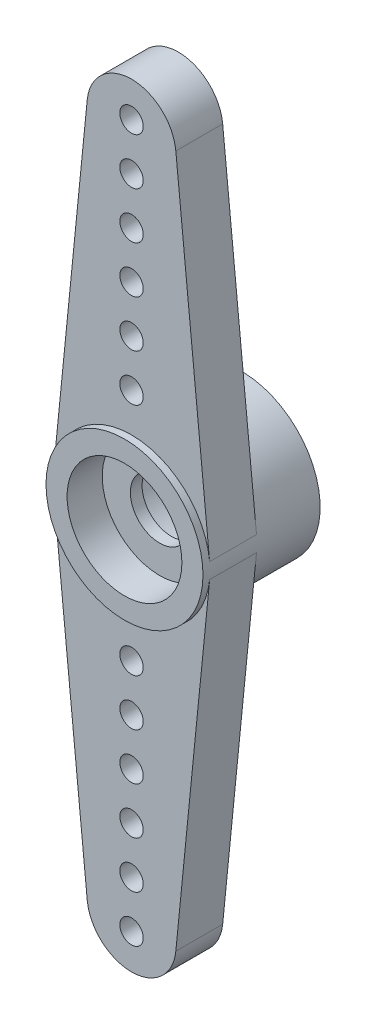
ISO-10303-21;
HEADER;
FILE_DESCRIPTION(('STEP AP214'),'2;1');
FILE_NAME('part.step','',(''),(''),'','','');
FILE_SCHEMA(('AUTOMOTIVE_DESIGN { 1 0 10303 214 1 1 1 1 }'));
ENDSEC;
DATA;
#1=APPLICATION_CONTEXT('core data for automotive mechanical design processes');
#2=APPLICATION_PROTOCOL_DEFINITION('international standard','automotive_design',2000,#1);
#3=PRODUCT_CONTEXT('',#1,'mechanical');
#4=PRODUCT('Part','Part','',(#3));
#5=PRODUCT_RELATED_PRODUCT_CATEGORY('part','',(#4));
#6=PRODUCT_DEFINITION_FORMATION('','',#4);
#7=PRODUCT_DEFINITION_CONTEXT('part definition',#1,'design');
#8=PRODUCT_DEFINITION('design','',#6,#7);
#9=PRODUCT_DEFINITION_SHAPE('','',#8);
#10=(LENGTH_UNIT() NAMED_UNIT(*) SI_UNIT(.MILLI.,.METRE.));
#11=(NAMED_UNIT(*) PLANE_ANGLE_UNIT() SI_UNIT($,.RADIAN.));
#12=(NAMED_UNIT(*) SI_UNIT($,.STERADIAN.) SOLID_ANGLE_UNIT());
#13=UNCERTAINTY_MEASURE_WITH_UNIT(LENGTH_MEASURE(1.E-05),#10,'distance_accuracy_value','');
#14=(GEOMETRIC_REPRESENTATION_CONTEXT(3) GLOBAL_UNCERTAINTY_ASSIGNED_CONTEXT((#13)) GLOBAL_UNIT_ASSIGNED_CONTEXT((#10,
#11,#12)) REPRESENTATION_CONTEXT('',''));
#15=CARTESIAN_POINT('',(0.,0.,0.));
#16=DIRECTION('',(0.,0.,1.));
#17=DIRECTION('',(1.,0.,0.));
#18=AXIS2_PLACEMENT_3D('',#15,#16,#17);
#19=CARTESIAN_POINT('',(0.,0.,-2.7));
#20=DIRECTION('',(0.,0.,1.));
#21=DIRECTION('',(1.,0.,0.));
#22=AXIS2_PLACEMENT_3D('',#19,#20,#21);
#23=CYLINDRICAL_SURFACE('',#22,1.25);
#24=CARTESIAN_POINT('',(0.,0.,0.8));
#25=DIRECTION('',(0.,0.,1.));
#26=DIRECTION('',(1.,0.,0.));
#27=AXIS2_PLACEMENT_3D('',#24,#25,#26);
#28=CIRCLE('',#27,1.25);
#29=CARTESIAN_POINT('',(1.25,0.,0.8));
#30=VERTEX_POINT('',#29);
#31=EDGE_CURVE('E175',#30,#30,#28,.T.);
#32=ORIENTED_EDGE('',*,*,#31,.T.);
#33=EDGE_LOOP('',(#32));
#34=FACE_BOUND('',#33,.T.);
#35=CARTESIAN_POINT('',(0.,0.,0.3));
#36=DIRECTION('',(0.,0.,-1.));
#37=DIRECTION('',(-1.,0.,0.));
#38=AXIS2_PLACEMENT_3D('',#35,#36,#37);
#39=CIRCLE('',#38,1.25);
#40=CARTESIAN_POINT('',(-1.25,0.,0.3));
#41=VERTEX_POINT('',#40);
#42=EDGE_CURVE('E43',#41,#41,#39,.F.);
#43=ORIENTED_EDGE('',*,*,#42,.F.);
#44=EDGE_LOOP('',(#43));
#45=FACE_BOUND('',#44,.T.);
#46=ADVANCED_FACE('F39',(#34,#45),#23,.F.);
#47=CARTESIAN_POINT('',(0.,0.,0.));
#48=DIRECTION('',(0.,0.,1.));
#49=DIRECTION('',(1.,0.,0.));
#50=AXIS2_PLACEMENT_3D('',#47,#48,#49);
#51=PLANE('',#50);
#52=CARTESIAN_POINT('',(0.,9.,0.));
#53=DIRECTION('',(0.,0.,1.));
#54=DIRECTION('',(1.,0.,0.));
#55=AXIS2_PLACEMENT_3D('',#52,#53,#54);
#56=CIRCLE('',#55,0.5);
#57=CARTESIAN_POINT('',(0.5,9.,0.));
#58=VERTEX_POINT('',#57);
#59=EDGE_CURVE('E192',#58,#58,#56,.T.);
#60=ORIENTED_EDGE('',*,*,#59,.T.);
#61=EDGE_LOOP('',(#60));
#62=FACE_BOUND('',#61,.T.);
#63=CARTESIAN_POINT('',(0.,13.,0.));
#64=DIRECTION('',(0.,0.,1.));
#65=DIRECTION('',(1.,0.,0.));
#66=AXIS2_PLACEMENT_3D('',#63,#64,#65);
#67=CIRCLE('',#66,0.5);
#68=CARTESIAN_POINT('',(0.5,13.,0.));
#69=VERTEX_POINT('',#68);
#70=EDGE_CURVE('E195',#69,#69,#67,.T.);
#71=ORIENTED_EDGE('',*,*,#70,.T.);
#72=EDGE_LOOP('',(#71));
#73=FACE_BOUND('',#72,.T.);
#74=CARTESIAN_POINT('',(0.,11.,0.));
#75=DIRECTION('',(0.,0.,1.));
#76=DIRECTION('',(1.,0.,0.));
#77=AXIS2_PLACEMENT_3D('',#74,#75,#76);
#78=CIRCLE('',#77,0.5);
#79=CARTESIAN_POINT('',(0.5,11.,0.));
#80=VERTEX_POINT('',#79);
#81=EDGE_CURVE('E198',#80,#80,#78,.T.);
#82=ORIENTED_EDGE('',*,*,#81,.T.);
#83=EDGE_LOOP('',(#82));
#84=FACE_BOUND('',#83,.T.);
#85=CARTESIAN_POINT('',(0.,7.,0.));
#86=DIRECTION('',(0.,0.,1.));
#87=DIRECTION('',(1.,0.,0.));
#88=AXIS2_PLACEMENT_3D('',#85,#86,#87);
#89=CIRCLE('',#88,0.5);
#90=CARTESIAN_POINT('',(0.5,7.,0.));
#91=VERTEX_POINT('',#90);
#92=EDGE_CURVE('E201',#91,#91,#89,.T.);
#93=ORIENTED_EDGE('',*,*,#92,.T.);
#94=EDGE_LOOP('',(#93));
#95=FACE_BOUND('',#94,.T.);
#96=CARTESIAN_POINT('',(0.,5.,0.));
#97=DIRECTION('',(0.,0.,1.));
#98=DIRECTION('',(1.,0.,0.));
#99=AXIS2_PLACEMENT_3D('',#96,#97,#98);
#100=CIRCLE('',#99,0.5);
#101=CARTESIAN_POINT('',(0.5,5.,0.));
#102=VERTEX_POINT('',#101);
#103=EDGE_CURVE('E204',#102,#102,#100,.T.);
#104=ORIENTED_EDGE('',*,*,#103,.T.);
#105=EDGE_LOOP('',(#104));
#106=FACE_BOUND('',#105,.T.);
#107=CARTESIAN_POINT('',(0.,15.,0.));
#108=DIRECTION('',(0.,0.,1.));
#109=DIRECTION('',(1.,0.,0.));
#110=AXIS2_PLACEMENT_3D('',#107,#108,#109);
#111=CIRCLE('',#110,0.5);
#112=CARTESIAN_POINT('',(0.500000000000002,15.,0.));
#113=VERTEX_POINT('',#112);
#114=EDGE_CURVE('E184',#113,#113,#111,.T.);
#115=ORIENTED_EDGE('',*,*,#114,.T.);
#116=EDGE_LOOP('',(#115));
#117=FACE_BOUND('',#116,.T.);
#118=CARTESIAN_POINT('',(0.,0.,0.));
#119=DIRECTION('',(0.,0.,-1.));
#120=DIRECTION('',(-1.,0.,0.));
#121=AXIS2_PLACEMENT_3D('',#118,#119,#120);
#122=CIRCLE('',#121,3.34999999999984);
#123=CARTESIAN_POINT('',(-3.33343772462327,0.33270547945204,0.));
#124=VERTEX_POINT('',#123);
#125=CARTESIAN_POINT('',(3.33343772462327,0.332705479452039,0.));
#126=VERTEX_POINT('',#125);
#127=EDGE_CURVE('E51',#124,#126,#122,.T.);
#128=ORIENTED_EDGE('',*,*,#127,.F.);
#129=DIRECTION('',(-0.0993150684931509,-0.995056037201022,0.));
#130=VECTOR('',#129,1.);
#131=CARTESIAN_POINT('',(-3.33343772462342,0.332705479452055,0.));
#132=LINE('',#131,#130);
#133=CARTESIAN_POINT('',(-1.89060647068194,14.788698630137,0.));
#134=VERTEX_POINT('',#133);
#135=EDGE_CURVE('E131',#134,#124,#132,.T.);
#136=ORIENTED_EDGE('',*,*,#135,.F.);
#137=CARTESIAN_POINT('',(0.,14.6,0.));
#138=DIRECTION('',(0.,0.,1.));
#139=DIRECTION('',(-1.,0.,0.));
#140=AXIS2_PLACEMENT_3D('',#137,#138,#139);
#141=CIRCLE('',#140,1.9);
#142=CARTESIAN_POINT('',(1.89060647068194,14.788698630137,0.));
#143=VERTEX_POINT('',#142);
#144=EDGE_CURVE('E128',#143,#134,#141,.T.);
#145=ORIENTED_EDGE('',*,*,#144,.F.);
#146=DIRECTION('',(-0.0993150684931505,0.995056037201022,0.));
#147=VECTOR('',#146,1.);
#148=CARTESIAN_POINT('',(3.33343772462342,0.332705479452054,0.));
#149=LINE('',#148,#147);
#150=EDGE_CURVE('E126',#126,#143,#149,.T.);
#151=ORIENTED_EDGE('',*,*,#150,.F.);
#152=EDGE_LOOP('',(#128,#136,#145,#151));
#153=FACE_BOUND('',#152,.T.);
#154=ADVANCED_FACE('F288',(#62,#73,#84,#95,#106,#117,#153),#51,.F.);
#155=CARTESIAN_POINT('',(0.,-11.,0.));
#156=DIRECTION('',(0.,0.,1.));
#157=DIRECTION('',(1.,0.,0.));
#158=AXIS2_PLACEMENT_3D('',#155,#156,#157);
#159=CIRCLE('',#158,0.5);
#160=CARTESIAN_POINT('',(0.5,-11.,0.));
#161=VERTEX_POINT('',#160);
#162=EDGE_CURVE('E207',#161,#161,#159,.T.);
#163=ORIENTED_EDGE('',*,*,#162,.T.);
#164=EDGE_LOOP('',(#163));
#165=FACE_BOUND('',#164,.T.);
#166=CARTESIAN_POINT('',(0.,-9.,0.));
#167=DIRECTION('',(0.,0.,1.));
#168=DIRECTION('',(1.,0.,0.));
#169=AXIS2_PLACEMENT_3D('',#166,#167,#168);
#170=CIRCLE('',#169,0.5);
#171=CARTESIAN_POINT('',(0.5,-9.,0.));
#172=VERTEX_POINT('',#171);
#173=EDGE_CURVE('E210',#172,#172,#170,.T.);
#174=ORIENTED_EDGE('',*,*,#173,.T.);
#175=EDGE_LOOP('',(#174));
#176=FACE_BOUND('',#175,.T.);
#177=CARTESIAN_POINT('',(0.,-13.,0.));
#178=DIRECTION('',(0.,0.,1.));
#179=DIRECTION('',(1.,0.,0.));
#180=AXIS2_PLACEMENT_3D('',#177,#178,#179);
#181=CIRCLE('',#180,0.5);
#182=CARTESIAN_POINT('',(0.5,-13.,0.));
#183=VERTEX_POINT('',#182);
#184=EDGE_CURVE('E213',#183,#183,#181,.T.);
#185=ORIENTED_EDGE('',*,*,#184,.T.);
#186=EDGE_LOOP('',(#185));
#187=FACE_BOUND('',#186,.T.);
#188=CARTESIAN_POINT('',(0.,-15.,0.));
#189=DIRECTION('',(0.,0.,1.));
#190=DIRECTION('',(1.,0.,0.));
#191=AXIS2_PLACEMENT_3D('',#188,#189,#190);
#192=CIRCLE('',#191,0.5);
#193=CARTESIAN_POINT('',(0.500000000000002,-15.,0.));
#194=VERTEX_POINT('',#193);
#195=EDGE_CURVE('E216',#194,#194,#192,.T.);
#196=ORIENTED_EDGE('',*,*,#195,.T.);
#197=EDGE_LOOP('',(#196));
#198=FACE_BOUND('',#197,.T.);
#199=CARTESIAN_POINT('',(0.,-5.,0.));
#200=DIRECTION('',(0.,0.,1.));
#201=DIRECTION('',(1.,0.,0.));
#202=AXIS2_PLACEMENT_3D('',#199,#200,#201);
#203=CIRCLE('',#202,0.5);
#204=CARTESIAN_POINT('',(0.5,-5.,0.));
#205=VERTEX_POINT('',#204);
#206=EDGE_CURVE('E219',#205,#205,#203,.T.);
#207=ORIENTED_EDGE('',*,*,#206,.T.);
#208=EDGE_LOOP('',(#207));
#209=FACE_BOUND('',#208,.T.);
#210=CARTESIAN_POINT('',(0.,-7.,0.));
#211=DIRECTION('',(0.,0.,1.));
#212=DIRECTION('',(1.,0.,0.));
#213=AXIS2_PLACEMENT_3D('',#210,#211,#212);
#214=CIRCLE('',#213,0.5);
#215=CARTESIAN_POINT('',(0.5,-7.,0.));
#216=VERTEX_POINT('',#215);
#217=EDGE_CURVE('E222',#216,#216,#214,.T.);
#218=ORIENTED_EDGE('',*,*,#217,.T.);
#219=EDGE_LOOP('',(#218));
#220=FACE_BOUND('',#219,.T.);
#221=CARTESIAN_POINT('',(3.33343772462327,-0.33270547945204,0.));
#222=VERTEX_POINT('',#221);
#223=CARTESIAN_POINT('',(-3.33343772462342,-0.332705479452055,0.));
#224=VERTEX_POINT('',#223);
#225=EDGE_CURVE('E11',#222,#224,#122,.T.);
#226=ORIENTED_EDGE('',*,*,#225,.F.);
#227=DIRECTION('',(0.0993150684931508,0.995056037201022,0.));
#228=VECTOR('',#227,1.);
#229=CARTESIAN_POINT('',(1.89060647068194,-14.788698630137,0.));
#230=LINE('',#229,#228);
#231=CARTESIAN_POINT('',(1.89060647068194,-14.788698630137,0.));
#232=VERTEX_POINT('',#231);
#233=EDGE_CURVE('E136',#232,#222,#230,.T.);
#234=ORIENTED_EDGE('',*,*,#233,.F.);
#235=CARTESIAN_POINT('',(0.,-14.6,0.));
#236=DIRECTION('',(0.,0.,1.));
#237=DIRECTION('',(1.,0.,0.));
#238=AXIS2_PLACEMENT_3D('',#235,#236,#237);
#239=CIRCLE('',#238,1.9);
#240=CARTESIAN_POINT('',(-1.89060647068194,-14.788698630137,0.));
#241=VERTEX_POINT('',#240);
#242=EDGE_CURVE('E86',#241,#232,#239,.T.);
#243=ORIENTED_EDGE('',*,*,#242,.F.);
#244=DIRECTION('',(0.0993150684931505,-0.995056037201022,0.));
#245=VECTOR('',#244,1.);
#246=CARTESIAN_POINT('',(-1.89060647068194,-14.788698630137,0.));
#247=LINE('',#246,#245);
#248=EDGE_CURVE('E79',#224,#241,#247,.T.);
#249=ORIENTED_EDGE('',*,*,#248,.F.);
#250=EDGE_LOOP('',(#226,#234,#243,#249));
#251=FACE_BOUND('',#250,.T.);
#252=ADVANCED_FACE('F265',(#165,#176,#187,#198,#209,#220,#251),#51,.F.);
#253=CARTESIAN_POINT('',(0.,0.,2.));
#254=DIRECTION('',(0.,0.,1.));
#255=DIRECTION('',(1.,0.,0.));
#256=AXIS2_PLACEMENT_3D('',#253,#254,#255);
#257=PLANE('',#256);
#258=CARTESIAN_POINT('',(0.,9.,2.));
#259=DIRECTION('',(0.,0.,1.));
#260=DIRECTION('',(1.,0.,0.));
#261=AXIS2_PLACEMENT_3D('',#258,#259,#260);
#262=CIRCLE('',#261,0.5);
#263=CARTESIAN_POINT('',(0.5,9.,2.));
#264=VERTEX_POINT('',#263);
#265=EDGE_CURVE('E244',#264,#264,#262,.T.);
#266=ORIENTED_EDGE('',*,*,#265,.F.);
#267=EDGE_LOOP('',(#266));
#268=FACE_BOUND('',#267,.T.);
#269=CARTESIAN_POINT('',(0.,13.,2.));
#270=DIRECTION('',(0.,0.,1.));
#271=DIRECTION('',(1.,0.,0.));
#272=AXIS2_PLACEMENT_3D('',#269,#270,#271);
#273=CIRCLE('',#272,0.5);
#274=CARTESIAN_POINT('',(0.5,13.,2.));
#275=VERTEX_POINT('',#274);
#276=EDGE_CURVE('E252',#275,#275,#273,.T.);
#277=ORIENTED_EDGE('',*,*,#276,.F.);
#278=EDGE_LOOP('',(#277));
#279=FACE_BOUND('',#278,.T.);
#280=CARTESIAN_POINT('',(0.,11.,2.));
#281=DIRECTION('',(0.,0.,1.));
#282=DIRECTION('',(1.,0.,0.));
#283=AXIS2_PLACEMENT_3D('',#280,#281,#282);
#284=CIRCLE('',#283,0.5);
#285=CARTESIAN_POINT('',(0.5,11.,2.));
#286=VERTEX_POINT('',#285);
#287=EDGE_CURVE('E247',#286,#286,#284,.T.);
#288=ORIENTED_EDGE('',*,*,#287,.F.);
#289=EDGE_LOOP('',(#288));
#290=FACE_BOUND('',#289,.T.);
#291=CARTESIAN_POINT('',(0.,7.,2.));
#292=DIRECTION('',(0.,0.,1.));
#293=DIRECTION('',(1.,0.,0.));
#294=AXIS2_PLACEMENT_3D('',#291,#292,#293);
#295=CIRCLE('',#294,0.5);
#296=CARTESIAN_POINT('',(0.5,7.,2.));
#297=VERTEX_POINT('',#296);
#298=EDGE_CURVE('E235',#297,#297,#295,.T.);
#299=ORIENTED_EDGE('',*,*,#298,.F.);
#300=EDGE_LOOP('',(#299));
#301=FACE_BOUND('',#300,.T.);
#302=CARTESIAN_POINT('',(0.,5.,2.));
#303=DIRECTION('',(0.,0.,1.));
#304=DIRECTION('',(1.,0.,0.));
#305=AXIS2_PLACEMENT_3D('',#302,#303,#304);
#306=CIRCLE('',#305,0.5);
#307=CARTESIAN_POINT('',(0.5,5.,2.));
#308=VERTEX_POINT('',#307);
#309=EDGE_CURVE('E229',#308,#308,#306,.T.);
#310=ORIENTED_EDGE('',*,*,#309,.F.);
#311=EDGE_LOOP('',(#310));
#312=FACE_BOUND('',#311,.T.);
#313=CARTESIAN_POINT('',(0.,15.,2.));
#314=DIRECTION('',(0.,0.,1.));
#315=DIRECTION('',(1.,0.,0.));
#316=AXIS2_PLACEMENT_3D('',#313,#314,#315);
#317=CIRCLE('',#316,0.5);
#318=CARTESIAN_POINT('',(0.500000000000002,15.,2.));
#319=VERTEX_POINT('',#318);
#320=EDGE_CURVE('E189',#319,#319,#317,.T.);
#321=ORIENTED_EDGE('',*,*,#320,.F.);
#322=EDGE_LOOP('',(#321));
#323=FACE_BOUND('',#322,.T.);
#324=CARTESIAN_POINT('',(0.,0.,2.));
#325=DIRECTION('',(0.,0.,1.));
#326=DIRECTION('',(1.,0.,0.));
#327=AXIS2_PLACEMENT_3D('',#324,#325,#326);
#328=CIRCLE('',#327,3.35);
#329=CARTESIAN_POINT('',(3.33343772462342,0.332705479452055,2.));
#330=VERTEX_POINT('',#329);
#331=CARTESIAN_POINT('',(-3.33343772462342,0.332705479452055,2.));
#332=VERTEX_POINT('',#331);
#333=EDGE_CURVE('E157',#330,#332,#328,.T.);
#334=ORIENTED_EDGE('',*,*,#333,.F.);
#335=DIRECTION('',(-0.0993150684931505,0.995056037201022,0.));
#336=VECTOR('',#335,1.);
#337=CARTESIAN_POINT('',(3.33343772462342,0.332705479452054,2.));
#338=LINE('',#337,#336);
#339=CARTESIAN_POINT('',(1.89060647068194,14.788698630137,2.));
#340=VERTEX_POINT('',#339);
#341=EDGE_CURVE('E95',#330,#340,#338,.T.);
#342=ORIENTED_EDGE('',*,*,#341,.T.);
#343=CARTESIAN_POINT('',(0.,14.6,2.));
#344=DIRECTION('',(0.,0.,1.));
#345=DIRECTION('',(-1.,0.,0.));
#346=AXIS2_PLACEMENT_3D('',#343,#344,#345);
#347=CIRCLE('',#346,1.9);
#348=CARTESIAN_POINT('',(-1.89060647068194,14.788698630137,2.));
#349=VERTEX_POINT('',#348);
#350=EDGE_CURVE('E572',#340,#349,#347,.T.);
#351=ORIENTED_EDGE('',*,*,#350,.T.);
#352=DIRECTION('',(-0.0993150684931509,-0.995056037201022,0.));
#353=VECTOR('',#352,1.);
#354=CARTESIAN_POINT('',(-3.33343772462342,0.332705479452055,2.));
#355=LINE('',#354,#353);
#356=EDGE_CURVE('E113',#349,#332,#355,.T.);
#357=ORIENTED_EDGE('',*,*,#356,.T.);
#358=EDGE_LOOP('',(#334,#342,#351,#357));
#359=FACE_BOUND('',#358,.T.);
#360=ADVANCED_FACE('F262',(#268,#279,#290,#301,#312,#323,#359),#257,.T.);
#361=CARTESIAN_POINT('',(3.33343772462342,0.332705479452054,2.));
#362=DIRECTION('',(-0.995056037201022,-0.0993150684931505,0.));
#363=DIRECTION('',(0.0993150684931505,-0.995056037201022,0.));
#364=AXIS2_PLACEMENT_3D('',#361,#362,#363);
#365=PLANE('',#364);
#366=ORIENTED_EDGE('',*,*,#150,.T.);
#367=DIRECTION('',(0.,0.,-1.));
#368=VECTOR('',#367,1.);
#369=CARTESIAN_POINT('',(1.89060647068194,14.788698630137,2.));
#370=LINE('',#369,#368);
#371=EDGE_CURVE('E149',#340,#143,#370,.T.);
#372=ORIENTED_EDGE('',*,*,#371,.F.);
#373=ORIENTED_EDGE('',*,*,#341,.F.);
#374=DIRECTION('',(0.,0.,-1.));
#375=VECTOR('',#374,1.);
#376=CARTESIAN_POINT('',(3.33343772462342,0.332705479452054,2.));
#377=LINE('',#376,#375);
#378=EDGE_CURVE('E151',#330,#126,#377,.T.);
#379=ORIENTED_EDGE('',*,*,#378,.T.);
#380=EDGE_LOOP('',(#366,#372,#373,#379));
#381=FACE_BOUND('',#380,.T.);
#382=ADVANCED_FACE('F41',(#381),#365,.F.);
#383=CARTESIAN_POINT('',(0.,14.6,2.));
#384=DIRECTION('',(0.,0.,-1.));
#385=DIRECTION('',(-1.,0.,0.));
#386=AXIS2_PLACEMENT_3D('',#383,#384,#385);
#387=CYLINDRICAL_SURFACE('',#386,1.9);
#388=ORIENTED_EDGE('',*,*,#144,.T.);
#389=DIRECTION('',(0.,0.,-1.));
#390=VECTOR('',#389,1.);
#391=CARTESIAN_POINT('',(-1.89060647068194,14.788698630137,2.));
#392=LINE('',#391,#390);
#393=EDGE_CURVE('E146',#349,#134,#392,.T.);
#394=ORIENTED_EDGE('',*,*,#393,.F.);
#395=ORIENTED_EDGE('',*,*,#350,.F.);
#396=ORIENTED_EDGE('',*,*,#371,.T.);
#397=EDGE_LOOP('',(#388,#394,#395,#396));
#398=FACE_BOUND('',#397,.T.);
#399=ADVANCED_FACE('F553',(#398),#387,.T.);
#400=CARTESIAN_POINT('',(-3.33343772462342,0.332705479452055,2.));
#401=DIRECTION('',(0.995056037201022,-0.0993150684931509,0.));
#402=DIRECTION('',(0.0993150684931509,0.995056037201022,0.));
#403=AXIS2_PLACEMENT_3D('',#400,#401,#402);
#404=PLANE('',#403);
#405=ORIENTED_EDGE('',*,*,#135,.T.);
#406=DIRECTION('',(0.,0.,-1.));
#407=VECTOR('',#406,1.);
#408=CARTESIAN_POINT('',(-3.33343772462342,0.332705479452055,2.));
#409=LINE('',#408,#407);
#410=EDGE_CURVE('E143',#332,#124,#409,.T.);
#411=ORIENTED_EDGE('',*,*,#410,.F.);
#412=ORIENTED_EDGE('',*,*,#356,.F.);
#413=ORIENTED_EDGE('',*,*,#393,.T.);
#414=EDGE_LOOP('',(#405,#411,#412,#413));
#415=FACE_BOUND('',#414,.T.);
#416=ADVANCED_FACE('F291',(#415),#404,.F.);
#417=CARTESIAN_POINT('',(-1.56558793706907E-13,0.,2.));
#418=DIRECTION('',(0.,0.,-1.));
#419=DIRECTION('',(-1.,0.,0.));
#420=AXIS2_PLACEMENT_3D('',#417,#418,#419);
#421=CYLINDRICAL_SURFACE('',#420,3.34999999999984);
#422=ORIENTED_EDGE('',*,*,#127,.T.);
#423=ORIENTED_EDGE('',*,*,#378,.F.);
#424=ORIENTED_EDGE('',*,*,#333,.T.);
#425=ORIENTED_EDGE('',*,*,#410,.T.);
#426=EDGE_LOOP('',(#422,#423,#424,#425));
#427=FACE_BOUND('',#426,.T.);
#428=DIRECTION('',(0.,0.,-1.));
#429=VECTOR('',#428,1.);
#430=CARTESIAN_POINT('',(3.33343772462342,-0.332705479452055,2.));
#431=LINE('',#430,#429);
#432=CARTESIAN_POINT('',(3.33343772462342,-0.332705479452055,2.));
#433=VERTEX_POINT('',#432);
#434=EDGE_CURVE('E122',#433,#222,#431,.T.);
#435=ORIENTED_EDGE('',*,*,#434,.T.);
#436=ORIENTED_EDGE('',*,*,#225,.T.);
#437=DIRECTION('',(0.,0.,-1.));
#438=VECTOR('',#437,1.);
#439=CARTESIAN_POINT('',(-3.33343772462342,-0.332705479452055,2.));
#440=LINE('',#439,#438);
#441=CARTESIAN_POINT('',(-3.33343772462342,-0.332705479452055,2.));
#442=VERTEX_POINT('',#441);
#443=EDGE_CURVE('E117',#442,#224,#440,.T.);
#444=ORIENTED_EDGE('',*,*,#443,.F.);
#445=EDGE_CURVE('E49',#442,#433,#328,.T.);
#446=ORIENTED_EDGE('',*,*,#445,.T.);
#447=EDGE_LOOP('',(#435,#436,#444,#446));
#448=FACE_BOUND('',#447,.T.);
#449=CARTESIAN_POINT('',(0.,0.,2.3));
#450=DIRECTION('',(0.,0.,1.));
#451=DIRECTION('',(1.,0.,0.));
#452=AXIS2_PLACEMENT_3D('',#449,#450,#451);
#453=CIRCLE('',#452,3.35);
#454=CARTESIAN_POINT('',(3.35,0.,2.3));
#455=VERTEX_POINT('',#454);
#456=EDGE_CURVE('E129',#455,#455,#453,.T.);
#457=ORIENTED_EDGE('',*,*,#456,.F.);
#458=EDGE_LOOP('',(#457));
#459=FACE_BOUND('',#458,.T.);
#460=CARTESIAN_POINT('',(0.,0.,-2.7));
#461=DIRECTION('',(0.,0.,-1.));
#462=DIRECTION('',(-1.,0.,0.));
#463=AXIS2_PLACEMENT_3D('',#460,#461,#462);
#464=CIRCLE('',#463,3.34999999999984);
#465=CARTESIAN_POINT('',(-3.34999999999984,0.,-2.7));
#466=VERTEX_POINT('',#465);
#467=EDGE_CURVE('E162',#466,#466,#464,.T.);
#468=ORIENTED_EDGE('',*,*,#467,.F.);
#469=EDGE_LOOP('',(#468));
#470=FACE_BOUND('',#469,.T.);
#471=ADVANCED_FACE('F293',(#427,#448,#459,#470),#421,.T.);
#472=CARTESIAN_POINT('',(-1.89060647068194,-14.788698630137,2.));
#473=DIRECTION('',(0.995056037201022,0.0993150684931505,0.));
#474=DIRECTION('',(-0.0993150684931505,0.995056037201022,0.));
#475=AXIS2_PLACEMENT_3D('',#472,#473,#474);
#476=PLANE('',#475);
#477=ORIENTED_EDGE('',*,*,#248,.T.);
#478=DIRECTION('',(0.,0.,-1.));
#479=VECTOR('',#478,1.);
#480=CARTESIAN_POINT('',(-1.89060647068194,-14.788698630137,2.));
#481=LINE('',#480,#479);
#482=CARTESIAN_POINT('',(-1.89060647068194,-14.788698630137,2.));
#483=VERTEX_POINT('',#482);
#484=EDGE_CURVE('E115',#483,#241,#481,.T.);
#485=ORIENTED_EDGE('',*,*,#484,.F.);
#486=DIRECTION('',(0.0993150684931505,-0.995056037201022,0.));
#487=VECTOR('',#486,1.);
#488=CARTESIAN_POINT('',(-1.89060647068194,-14.788698630137,2.));
#489=LINE('',#488,#487);
#490=EDGE_CURVE('E107',#442,#483,#489,.T.);
#491=ORIENTED_EDGE('',*,*,#490,.F.);
#492=ORIENTED_EDGE('',*,*,#443,.T.);
#493=EDGE_LOOP('',(#477,#485,#491,#492));
#494=FACE_BOUND('',#493,.T.);
#495=ADVANCED_FACE('F116',(#494),#476,.F.);
#496=CARTESIAN_POINT('',(0.,-14.6,2.));
#497=DIRECTION('',(0.,0.,-1.));
#498=DIRECTION('',(-1.,0.,0.));
#499=AXIS2_PLACEMENT_3D('',#496,#497,#498);
#500=CYLINDRICAL_SURFACE('',#499,1.9);
#501=ORIENTED_EDGE('',*,*,#242,.T.);
#502=DIRECTION('',(0.,0.,-1.));
#503=VECTOR('',#502,1.);
#504=CARTESIAN_POINT('',(1.89060647068194,-14.788698630137,2.));
#505=LINE('',#504,#503);
#506=CARTESIAN_POINT('',(1.89060647068194,-14.788698630137,2.));
#507=VERTEX_POINT('',#506);
#508=EDGE_CURVE('E118',#507,#232,#505,.T.);
#509=ORIENTED_EDGE('',*,*,#508,.F.);
#510=CARTESIAN_POINT('',(0.,-14.6,2.));
#511=DIRECTION('',(0.,0.,1.));
#512=DIRECTION('',(1.,0.,0.));
#513=AXIS2_PLACEMENT_3D('',#510,#511,#512);
#514=CIRCLE('',#513,1.9);
#515=EDGE_CURVE('E110',#483,#507,#514,.T.);
#516=ORIENTED_EDGE('',*,*,#515,.F.);
#517=ORIENTED_EDGE('',*,*,#484,.T.);
#518=EDGE_LOOP('',(#501,#509,#516,#517));
#519=FACE_BOUND('',#518,.T.);
#520=ADVANCED_FACE('F120',(#519),#500,.T.);
#521=CARTESIAN_POINT('',(1.89060647068194,-14.788698630137,2.));
#522=DIRECTION('',(-0.995056037201022,0.0993150684931508,0.));
#523=DIRECTION('',(-0.0993150684931508,-0.995056037201022,0.));
#524=AXIS2_PLACEMENT_3D('',#521,#522,#523);
#525=PLANE('',#524);
#526=ORIENTED_EDGE('',*,*,#233,.T.);
#527=ORIENTED_EDGE('',*,*,#434,.F.);
#528=DIRECTION('',(0.0993150684931508,0.995056037201022,0.));
#529=VECTOR('',#528,1.);
#530=CARTESIAN_POINT('',(1.89060647068194,-14.788698630137,2.));
#531=LINE('',#530,#529);
#532=EDGE_CURVE('E59',#507,#433,#531,.T.);
#533=ORIENTED_EDGE('',*,*,#532,.F.);
#534=ORIENTED_EDGE('',*,*,#508,.T.);
#535=EDGE_LOOP('',(#526,#527,#533,#534));
#536=FACE_BOUND('',#535,.T.);
#537=ADVANCED_FACE('F312',(#536),#525,.F.);
#538=CARTESIAN_POINT('',(0.,-11.,2.));
#539=DIRECTION('',(0.,0.,1.));
#540=DIRECTION('',(1.,0.,0.));
#541=AXIS2_PLACEMENT_3D('',#538,#539,#540);
#542=CIRCLE('',#541,0.5);
#543=CARTESIAN_POINT('',(0.5,-11.,2.));
#544=VERTEX_POINT('',#543);
#545=EDGE_CURVE('E243',#544,#544,#542,.T.);
#546=ORIENTED_EDGE('',*,*,#545,.F.);
#547=EDGE_LOOP('',(#546));
#548=FACE_BOUND('',#547,.T.);
#549=CARTESIAN_POINT('',(0.,-9.,2.));
#550=DIRECTION('',(0.,0.,1.));
#551=DIRECTION('',(1.,0.,0.));
#552=AXIS2_PLACEMENT_3D('',#549,#550,#551);
#553=CIRCLE('',#552,0.5);
#554=CARTESIAN_POINT('',(0.5,-9.,2.));
#555=VERTEX_POINT('',#554);
#556=EDGE_CURVE('E238',#555,#555,#553,.T.);
#557=ORIENTED_EDGE('',*,*,#556,.F.);
#558=EDGE_LOOP('',(#557));
#559=FACE_BOUND('',#558,.T.);
#560=CARTESIAN_POINT('',(0.,-13.,2.));
#561=DIRECTION('',(0.,0.,1.));
#562=DIRECTION('',(1.,0.,0.));
#563=AXIS2_PLACEMENT_3D('',#560,#561,#562);
#564=CIRCLE('',#563,0.5);
#565=CARTESIAN_POINT('',(0.5,-13.,2.));
#566=VERTEX_POINT('',#565);
#567=EDGE_CURVE('E253',#566,#566,#564,.T.);
#568=ORIENTED_EDGE('',*,*,#567,.F.);
#569=EDGE_LOOP('',(#568));
#570=FACE_BOUND('',#569,.T.);
#571=CARTESIAN_POINT('',(0.,-15.,2.));
#572=DIRECTION('',(0.,0.,1.));
#573=DIRECTION('',(1.,0.,0.));
#574=AXIS2_PLACEMENT_3D('',#571,#572,#573);
#575=CIRCLE('',#574,0.5);
#576=CARTESIAN_POINT('',(0.500000000000002,-15.,2.));
#577=VERTEX_POINT('',#576);
#578=EDGE_CURVE('E225',#577,#577,#575,.T.);
#579=ORIENTED_EDGE('',*,*,#578,.F.);
#580=EDGE_LOOP('',(#579));
#581=FACE_BOUND('',#580,.T.);
#582=CARTESIAN_POINT('',(0.,-5.,2.));
#583=DIRECTION('',(0.,0.,1.));
#584=DIRECTION('',(1.,0.,0.));
#585=AXIS2_PLACEMENT_3D('',#582,#583,#584);
#586=CIRCLE('',#585,0.5);
#587=CARTESIAN_POINT('',(0.5,-5.,2.));
#588=VERTEX_POINT('',#587);
#589=EDGE_CURVE('E226',#588,#588,#586,.T.);
#590=ORIENTED_EDGE('',*,*,#589,.F.);
#591=EDGE_LOOP('',(#590));
#592=FACE_BOUND('',#591,.T.);
#593=CARTESIAN_POINT('',(0.,-7.,2.));
#594=DIRECTION('',(0.,0.,1.));
#595=DIRECTION('',(1.,0.,0.));
#596=AXIS2_PLACEMENT_3D('',#593,#594,#595);
#597=CIRCLE('',#596,0.5);
#598=CARTESIAN_POINT('',(0.5,-7.,2.));
#599=VERTEX_POINT('',#598);
#600=EDGE_CURVE('E234',#599,#599,#597,.T.);
#601=ORIENTED_EDGE('',*,*,#600,.F.);
#602=EDGE_LOOP('',(#601));
#603=FACE_BOUND('',#602,.T.);
#604=ORIENTED_EDGE('',*,*,#445,.F.);
#605=ORIENTED_EDGE('',*,*,#490,.T.);
#606=ORIENTED_EDGE('',*,*,#515,.T.);
#607=ORIENTED_EDGE('',*,*,#532,.T.);
#608=EDGE_LOOP('',(#604,#605,#606,#607));
#609=FACE_BOUND('',#608,.T.);
#610=ADVANCED_FACE('F108',(#548,#559,#570,#581,#592,#603,#609),#257,.T.);
#611=CARTESIAN_POINT('',(0.,0.,2.3));
#612=DIRECTION('',(0.,0.,1.));
#613=DIRECTION('',(1.,0.,0.));
#614=AXIS2_PLACEMENT_3D('',#611,#612,#613);
#615=PLANE('',#614);
#616=CARTESIAN_POINT('',(0.,0.,2.3));
#617=DIRECTION('',(0.,0.,1.));
#618=DIRECTION('',(1.,0.,0.));
#619=AXIS2_PLACEMENT_3D('',#616,#617,#618);
#620=CIRCLE('',#619,2.45);
#621=CARTESIAN_POINT('',(2.45,0.,2.3));
#622=VERTEX_POINT('',#621);
#623=EDGE_CURVE('E172',#622,#622,#620,.T.);
#624=ORIENTED_EDGE('',*,*,#623,.F.);
#625=EDGE_LOOP('',(#624));
#626=FACE_BOUND('',#625,.T.);
#627=ORIENTED_EDGE('',*,*,#456,.T.);
#628=EDGE_LOOP('',(#627));
#629=FACE_BOUND('',#628,.T.);
#630=ADVANCED_FACE('F300',(#626,#629),#615,.T.);
#631=CARTESIAN_POINT('',(0.,0.,-2.7));
#632=DIRECTION('',(0.,0.,-1.));
#633=DIRECTION('',(-1.,0.,0.));
#634=AXIS2_PLACEMENT_3D('',#631,#632,#633);
#635=PLANE('',#634);
#636=CARTESIAN_POINT('',(0.,0.,-2.7));
#637=DIRECTION('',(0.,0.,-1.));
#638=DIRECTION('',(-1.,0.,0.));
#639=AXIS2_PLACEMENT_3D('',#636,#637,#638);
#640=CIRCLE('',#639,2.45);
#641=CARTESIAN_POINT('',(-2.45,0.,-2.7));
#642=VERTEX_POINT('',#641);
#643=EDGE_CURVE('E180',#642,#642,#640,.T.);
#644=ORIENTED_EDGE('',*,*,#643,.F.);
#645=EDGE_LOOP('',(#644));
#646=FACE_BOUND('',#645,.T.);
#647=ORIENTED_EDGE('',*,*,#467,.T.);
#648=EDGE_LOOP('',(#647));
#649=FACE_BOUND('',#648,.T.);
#650=ADVANCED_FACE('F302',(#646,#649),#635,.T.);
#651=CARTESIAN_POINT('',(0.,0.,0.8));
#652=DIRECTION('',(0.,0.,1.));
#653=DIRECTION('',(1.,0.,0.));
#654=AXIS2_PLACEMENT_3D('',#651,#652,#653);
#655=CYLINDRICAL_SURFACE('',#654,2.45);
#656=CARTESIAN_POINT('',(0.,0.,0.8));
#657=DIRECTION('',(0.,0.,1.));
#658=DIRECTION('',(1.,0.,0.));
#659=AXIS2_PLACEMENT_3D('',#656,#657,#658);
#660=CIRCLE('',#659,2.45);
#661=CARTESIAN_POINT('',(2.45,0.,0.8));
#662=VERTEX_POINT('',#661);
#663=EDGE_CURVE('E170',#662,#662,#660,.T.);
#664=ORIENTED_EDGE('',*,*,#663,.F.);
#665=EDGE_LOOP('',(#664));
#666=FACE_BOUND('',#665,.T.);
#667=ORIENTED_EDGE('',*,*,#623,.T.);
#668=EDGE_LOOP('',(#667));
#669=FACE_BOUND('',#668,.T.);
#670=ADVANCED_FACE('F309',(#666,#669),#655,.F.);
#671=CARTESIAN_POINT('',(0.,0.,0.8));
#672=DIRECTION('',(0.,0.,1.));
#673=DIRECTION('',(1.,0.,0.));
#674=AXIS2_PLACEMENT_3D('',#671,#672,#673);
#675=PLANE('',#674);
#676=ORIENTED_EDGE('',*,*,#31,.F.);
#677=EDGE_LOOP('',(#676));
#678=FACE_BOUND('',#677,.T.);
#679=ORIENTED_EDGE('',*,*,#663,.T.);
#680=EDGE_LOOP('',(#679));
#681=FACE_BOUND('',#680,.T.);
#682=ADVANCED_FACE('F328',(#678,#681),#675,.T.);
#683=CARTESIAN_POINT('',(0.,0.,0.3));
#684=DIRECTION('',(0.,0.,-1.));
#685=DIRECTION('',(-1.,0.,0.));
#686=AXIS2_PLACEMENT_3D('',#683,#684,#685);
#687=PLANE('',#686);
#688=CARTESIAN_POINT('',(0.,0.,0.3));
#689=DIRECTION('',(0.,0.,-1.));
#690=DIRECTION('',(-1.,0.,0.));
#691=AXIS2_PLACEMENT_3D('',#688,#689,#690);
#692=CIRCLE('',#691,2.45);
#693=CARTESIAN_POINT('',(-2.45,0.,0.3));
#694=VERTEX_POINT('',#693);
#695=EDGE_CURVE('E183',#694,#694,#692,.T.);
#696=ORIENTED_EDGE('',*,*,#695,.T.);
#697=EDGE_LOOP('',(#696));
#698=FACE_BOUND('',#697,.T.);
#699=ORIENTED_EDGE('',*,*,#42,.T.);
#700=EDGE_LOOP('',(#699));
#701=FACE_BOUND('',#700,.T.);
#702=ADVANCED_FACE('F331',(#698,#701),#687,.T.);
#703=CARTESIAN_POINT('',(0.,0.,0.3));
#704=DIRECTION('',(0.,0.,-1.));
#705=DIRECTION('',(-1.,0.,0.));
#706=AXIS2_PLACEMENT_3D('',#703,#704,#705);
#707=CYLINDRICAL_SURFACE('',#706,2.45);
#708=ORIENTED_EDGE('',*,*,#695,.F.);
#709=EDGE_LOOP('',(#708));
#710=FACE_BOUND('',#709,.T.);
#711=ORIENTED_EDGE('',*,*,#643,.T.);
#712=EDGE_LOOP('',(#711));
#713=FACE_BOUND('',#712,.T.);
#714=ADVANCED_FACE('F326',(#710,#713),#707,.F.);
#715=CARTESIAN_POINT('',(0.,15.,-2.7));
#716=DIRECTION('',(0.,0.,1.));
#717=DIRECTION('',(1.,0.,0.));
#718=AXIS2_PLACEMENT_3D('',#715,#716,#717);
#719=CYLINDRICAL_SURFACE('',#718,0.5);
#720=ORIENTED_EDGE('',*,*,#320,.T.);
#721=EDGE_LOOP('',(#720));
#722=FACE_BOUND('',#721,.T.);
#723=ORIENTED_EDGE('',*,*,#114,.F.);
#724=EDGE_LOOP('',(#723));
#725=FACE_BOUND('',#724,.T.);
#726=ADVANCED_FACE('F358',(#722,#725),#719,.F.);
#727=CARTESIAN_POINT('',(0.,-7.,-2.7));
#728=DIRECTION('',(0.,0.,1.));
#729=DIRECTION('',(1.,0.,0.));
#730=AXIS2_PLACEMENT_3D('',#727,#728,#729);
#731=CYLINDRICAL_SURFACE('',#730,0.5);
#732=ORIENTED_EDGE('',*,*,#600,.T.);
#733=EDGE_LOOP('',(#732));
#734=FACE_BOUND('',#733,.T.);
#735=ORIENTED_EDGE('',*,*,#217,.F.);
#736=EDGE_LOOP('',(#735));
#737=FACE_BOUND('',#736,.T.);
#738=ADVANCED_FACE('F366',(#734,#737),#731,.F.);
#739=CARTESIAN_POINT('',(0.,-5.,-2.7));
#740=DIRECTION('',(0.,0.,1.));
#741=DIRECTION('',(1.,0.,0.));
#742=AXIS2_PLACEMENT_3D('',#739,#740,#741);
#743=CYLINDRICAL_SURFACE('',#742,0.5);
#744=ORIENTED_EDGE('',*,*,#589,.T.);
#745=EDGE_LOOP('',(#744));
#746=FACE_BOUND('',#745,.T.);
#747=ORIENTED_EDGE('',*,*,#206,.F.);
#748=EDGE_LOOP('',(#747));
#749=FACE_BOUND('',#748,.T.);
#750=ADVANCED_FACE('F375',(#746,#749),#743,.F.);
#751=CARTESIAN_POINT('',(0.,-15.,-2.7));
#752=DIRECTION('',(0.,0.,1.));
#753=DIRECTION('',(1.,0.,0.));
#754=AXIS2_PLACEMENT_3D('',#751,#752,#753);
#755=CYLINDRICAL_SURFACE('',#754,0.5);
#756=ORIENTED_EDGE('',*,*,#578,.T.);
#757=EDGE_LOOP('',(#756));
#758=FACE_BOUND('',#757,.T.);
#759=ORIENTED_EDGE('',*,*,#195,.F.);
#760=EDGE_LOOP('',(#759));
#761=FACE_BOUND('',#760,.T.);
#762=ADVANCED_FACE('F383',(#758,#761),#755,.F.);
#763=CARTESIAN_POINT('',(0.,-13.,-2.7));
#764=DIRECTION('',(0.,0.,1.));
#765=DIRECTION('',(1.,0.,0.));
#766=AXIS2_PLACEMENT_3D('',#763,#764,#765);
#767=CYLINDRICAL_SURFACE('',#766,0.5);
#768=ORIENTED_EDGE('',*,*,#567,.T.);
#769=EDGE_LOOP('',(#768));
#770=FACE_BOUND('',#769,.T.);
#771=ORIENTED_EDGE('',*,*,#184,.F.);
#772=EDGE_LOOP('',(#771));
#773=FACE_BOUND('',#772,.T.);
#774=ADVANCED_FACE('F391',(#770,#773),#767,.F.);
#775=CARTESIAN_POINT('',(0.,-9.,-2.7));
#776=DIRECTION('',(0.,0.,1.));
#777=DIRECTION('',(1.,0.,0.));
#778=AXIS2_PLACEMENT_3D('',#775,#776,#777);
#779=CYLINDRICAL_SURFACE('',#778,0.5);
#780=ORIENTED_EDGE('',*,*,#556,.T.);
#781=EDGE_LOOP('',(#780));
#782=FACE_BOUND('',#781,.T.);
#783=ORIENTED_EDGE('',*,*,#173,.F.);
#784=EDGE_LOOP('',(#783));
#785=FACE_BOUND('',#784,.T.);
#786=ADVANCED_FACE('F399',(#782,#785),#779,.F.);
#787=CARTESIAN_POINT('',(0.,-11.,-2.7));
#788=DIRECTION('',(0.,0.,1.));
#789=DIRECTION('',(1.,0.,0.));
#790=AXIS2_PLACEMENT_3D('',#787,#788,#789);
#791=CYLINDRICAL_SURFACE('',#790,0.5);
#792=ORIENTED_EDGE('',*,*,#545,.T.);
#793=EDGE_LOOP('',(#792));
#794=FACE_BOUND('',#793,.T.);
#795=ORIENTED_EDGE('',*,*,#162,.F.);
#796=EDGE_LOOP('',(#795));
#797=FACE_BOUND('',#796,.T.);
#798=ADVANCED_FACE('F407',(#794,#797),#791,.F.);
#799=CARTESIAN_POINT('',(0.,5.,-2.7));
#800=DIRECTION('',(0.,0.,1.));
#801=DIRECTION('',(1.,0.,0.));
#802=AXIS2_PLACEMENT_3D('',#799,#800,#801);
#803=CYLINDRICAL_SURFACE('',#802,0.5);
#804=ORIENTED_EDGE('',*,*,#309,.T.);
#805=EDGE_LOOP('',(#804));
#806=FACE_BOUND('',#805,.T.);
#807=ORIENTED_EDGE('',*,*,#103,.F.);
#808=EDGE_LOOP('',(#807));
#809=FACE_BOUND('',#808,.T.);
#810=ADVANCED_FACE('F415',(#806,#809),#803,.F.);
#811=CARTESIAN_POINT('',(0.,7.,-2.7));
#812=DIRECTION('',(0.,0.,1.));
#813=DIRECTION('',(1.,0.,0.));
#814=AXIS2_PLACEMENT_3D('',#811,#812,#813);
#815=CYLINDRICAL_SURFACE('',#814,0.5);
#816=ORIENTED_EDGE('',*,*,#298,.T.);
#817=EDGE_LOOP('',(#816));
#818=FACE_BOUND('',#817,.T.);
#819=ORIENTED_EDGE('',*,*,#92,.F.);
#820=EDGE_LOOP('',(#819));
#821=FACE_BOUND('',#820,.T.);
#822=ADVANCED_FACE('F423',(#818,#821),#815,.F.);
#823=CARTESIAN_POINT('',(0.,11.,-2.7));
#824=DIRECTION('',(0.,0.,1.));
#825=DIRECTION('',(1.,0.,0.));
#826=AXIS2_PLACEMENT_3D('',#823,#824,#825);
#827=CYLINDRICAL_SURFACE('',#826,0.5);
#828=ORIENTED_EDGE('',*,*,#287,.T.);
#829=EDGE_LOOP('',(#828));
#830=FACE_BOUND('',#829,.T.);
#831=ORIENTED_EDGE('',*,*,#81,.F.);
#832=EDGE_LOOP('',(#831));
#833=FACE_BOUND('',#832,.T.);
#834=ADVANCED_FACE('F431',(#830,#833),#827,.F.);
#835=CARTESIAN_POINT('',(0.,13.,-2.7));
#836=DIRECTION('',(0.,0.,1.));
#837=DIRECTION('',(1.,0.,0.));
#838=AXIS2_PLACEMENT_3D('',#835,#836,#837);
#839=CYLINDRICAL_SURFACE('',#838,0.5);
#840=ORIENTED_EDGE('',*,*,#276,.T.);
#841=EDGE_LOOP('',(#840));
#842=FACE_BOUND('',#841,.T.);
#843=ORIENTED_EDGE('',*,*,#70,.F.);
#844=EDGE_LOOP('',(#843));
#845=FACE_BOUND('',#844,.T.);
#846=ADVANCED_FACE('F259',(#842,#845),#839,.F.);
#847=CARTESIAN_POINT('',(0.,9.,-2.7));
#848=DIRECTION('',(0.,0.,1.));
#849=DIRECTION('',(1.,0.,0.));
#850=AXIS2_PLACEMENT_3D('',#847,#848,#849);
#851=CYLINDRICAL_SURFACE('',#850,0.5);
#852=ORIENTED_EDGE('',*,*,#265,.T.);
#853=EDGE_LOOP('',(#852));
#854=FACE_BOUND('',#853,.T.);
#855=ORIENTED_EDGE('',*,*,#59,.F.);
#856=EDGE_LOOP('',(#855));
#857=FACE_BOUND('',#856,.T.);
#858=ADVANCED_FACE('F446',(#854,#857),#851,.F.);
#859=CLOSED_SHELL('',(#46,#154,#252,#360,#382,#399,#416,#471,#495,#520,#537,#610,#630,#650,#670,
#682,#702,#714,#726,#738,#750,#762,#774,#786,#798,#810,#822,#834,#846,#858));
#860=MANIFOLD_SOLID_BREP('B2',#859);
#861=ADVANCED_BREP_SHAPE_REPRESENTATION('',(#18,#860),#14);
#862=SHAPE_DEFINITION_REPRESENTATION(#9,#861);
ENDSEC;
END-ISO-10303-21;
